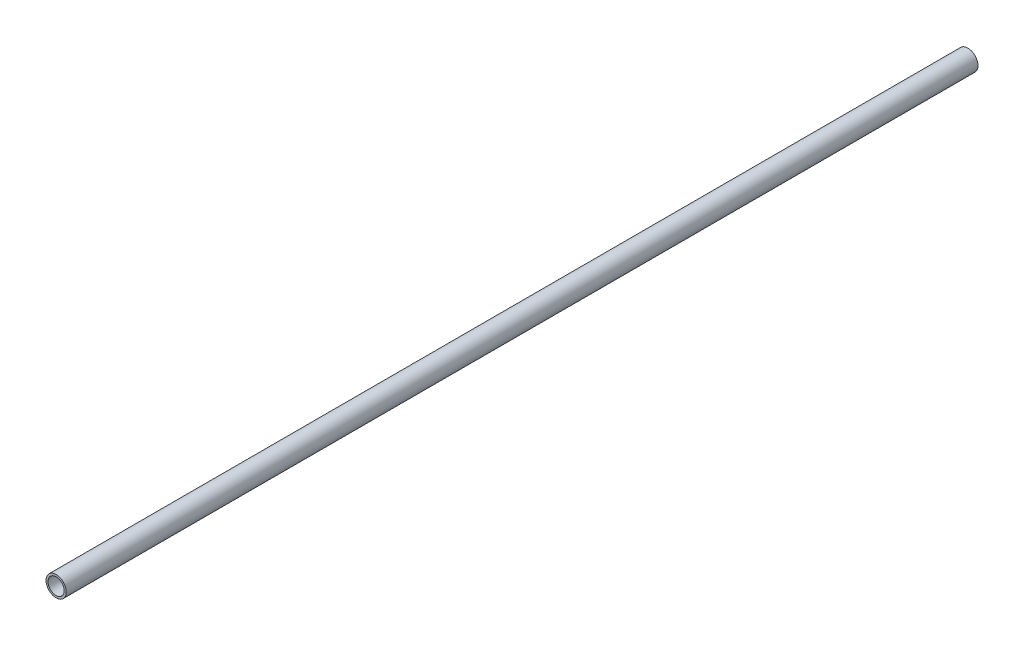
ISO-10303-21;
HEADER;
FILE_DESCRIPTION(('STEP AP214'),'2;1');
FILE_NAME('part.step','',(''),(''),'','','');
FILE_SCHEMA(('AUTOMOTIVE_DESIGN { 1 0 10303 214 1 1 1 1 }'));
ENDSEC;
DATA;
#1=APPLICATION_CONTEXT('core data for automotive mechanical design processes');
#2=APPLICATION_PROTOCOL_DEFINITION('international standard','automotive_design',2000,#1);
#3=PRODUCT_CONTEXT('',#1,'mechanical');
#4=PRODUCT('Part','Part','',(#3));
#5=PRODUCT_RELATED_PRODUCT_CATEGORY('part','',(#4));
#6=PRODUCT_DEFINITION_FORMATION('','',#4);
#7=PRODUCT_DEFINITION_CONTEXT('part definition',#1,'design');
#8=PRODUCT_DEFINITION('design','',#6,#7);
#9=PRODUCT_DEFINITION_SHAPE('','',#8);
#10=(LENGTH_UNIT() NAMED_UNIT(*) SI_UNIT(.MILLI.,.METRE.));
#11=(NAMED_UNIT(*) PLANE_ANGLE_UNIT() SI_UNIT($,.RADIAN.));
#12=(NAMED_UNIT(*) SI_UNIT($,.STERADIAN.) SOLID_ANGLE_UNIT());
#13=UNCERTAINTY_MEASURE_WITH_UNIT(LENGTH_MEASURE(1.E-05),#10,'distance_accuracy_value','');
#14=(GEOMETRIC_REPRESENTATION_CONTEXT(3) GLOBAL_UNCERTAINTY_ASSIGNED_CONTEXT((#13)) GLOBAL_UNIT_ASSIGNED_CONTEXT((#10,
#11,#12)) REPRESENTATION_CONTEXT('',''));
#15=CARTESIAN_POINT('',(0.,0.,0.));
#16=DIRECTION('',(0.,0.,1.));
#17=DIRECTION('',(1.,0.,0.));
#18=AXIS2_PLACEMENT_3D('',#15,#16,#17);
#19=CARTESIAN_POINT('',(0.,0.,450.));
#20=DIRECTION('',(0.,0.,1.));
#21=DIRECTION('',(1.,0.,0.));
#22=AXIS2_PLACEMENT_3D('',#19,#20,#21);
#23=PLANE('',#22);
#24=CARTESIAN_POINT('',(0.,0.,450.));
#25=DIRECTION('',(0.,0.,1.));
#26=DIRECTION('',(1.,0.,0.));
#27=AXIS2_PLACEMENT_3D('',#24,#25,#26);
#28=CIRCLE('',#27,5.);
#29=CARTESIAN_POINT('',(5.,0.,450.));
#30=VERTEX_POINT('',#29);
#31=EDGE_CURVE('E10',#30,#30,#28,.T.);
#32=ORIENTED_EDGE('',*,*,#31,.T.);
#33=EDGE_LOOP('',(#32));
#34=FACE_BOUND('',#33,.T.);
#35=CARTESIAN_POINT('',(0.,0.,450.));
#36=DIRECTION('',(0.,0.,1.));
#37=DIRECTION('',(1.,0.,0.));
#38=AXIS2_PLACEMENT_3D('',#35,#36,#37);
#39=CIRCLE('',#38,4.);
#40=CARTESIAN_POINT('',(4.,0.,450.));
#41=VERTEX_POINT('',#40);
#42=EDGE_CURVE('E42',#41,#41,#39,.T.);
#43=ORIENTED_EDGE('',*,*,#42,.F.);
#44=EDGE_LOOP('',(#43));
#45=FACE_BOUND('',#44,.T.);
#46=ADVANCED_FACE('F31',(#34,#45),#23,.T.);
#47=CARTESIAN_POINT('',(0.,0.,0.));
#48=DIRECTION('',(0.,0.,1.));
#49=DIRECTION('',(1.,0.,0.));
#50=AXIS2_PLACEMENT_3D('',#47,#48,#49);
#51=PLANE('',#50);
#52=CARTESIAN_POINT('',(0.,0.,0.));
#53=DIRECTION('',(0.,0.,1.));
#54=DIRECTION('',(1.,0.,0.));
#55=AXIS2_PLACEMENT_3D('',#52,#53,#54);
#56=CIRCLE('',#55,5.);
#57=CARTESIAN_POINT('',(5.,0.,0.));
#58=VERTEX_POINT('',#57);
#59=EDGE_CURVE('E35',#58,#58,#56,.T.);
#60=ORIENTED_EDGE('',*,*,#59,.F.);
#61=EDGE_LOOP('',(#60));
#62=FACE_BOUND('',#61,.T.);
#63=CARTESIAN_POINT('',(0.,0.,0.));
#64=DIRECTION('',(0.,0.,1.));
#65=DIRECTION('',(1.,0.,0.));
#66=AXIS2_PLACEMENT_3D('',#63,#64,#65);
#67=CIRCLE('',#66,4.);
#68=CARTESIAN_POINT('',(4.,0.,0.));
#69=VERTEX_POINT('',#68);
#70=EDGE_CURVE('E44',#69,#69,#67,.T.);
#71=ORIENTED_EDGE('',*,*,#70,.T.);
#72=EDGE_LOOP('',(#71));
#73=FACE_BOUND('',#72,.T.);
#74=ADVANCED_FACE('F54',(#62,#73),#51,.F.);
#75=CARTESIAN_POINT('',(0.,0.,450.));
#76=DIRECTION('',(0.,0.,-1.));
#77=DIRECTION('',(-1.,0.,0.));
#78=AXIS2_PLACEMENT_3D('',#75,#76,#77);
#79=CYLINDRICAL_SURFACE('',#78,5.);
#80=ORIENTED_EDGE('',*,*,#31,.F.);
#81=EDGE_LOOP('',(#80));
#82=FACE_BOUND('',#81,.T.);
#83=ORIENTED_EDGE('',*,*,#59,.T.);
#84=EDGE_LOOP('',(#83));
#85=FACE_BOUND('',#84,.T.);
#86=ADVANCED_FACE('F33',(#82,#85),#79,.T.);
#87=CARTESIAN_POINT('',(0.,0.,450.));
#88=DIRECTION('',(0.,0.,-1.));
#89=DIRECTION('',(-1.,0.,0.));
#90=AXIS2_PLACEMENT_3D('',#87,#88,#89);
#91=CYLINDRICAL_SURFACE('',#90,4.);
#92=ORIENTED_EDGE('',*,*,#42,.T.);
#93=EDGE_LOOP('',(#92));
#94=FACE_BOUND('',#93,.T.);
#95=ORIENTED_EDGE('',*,*,#70,.F.);
#96=EDGE_LOOP('',(#95));
#97=FACE_BOUND('',#96,.T.);
#98=ADVANCED_FACE('F50',(#94,#97),#91,.F.);
#99=CLOSED_SHELL('',(#46,#74,#86,#98));
#100=MANIFOLD_SOLID_BREP('B2',#99);
#101=ADVANCED_BREP_SHAPE_REPRESENTATION('',(#18,#100),#14);
#102=SHAPE_DEFINITION_REPRESENTATION(#9,#101);
ENDSEC;
END-ISO-10303-21;
